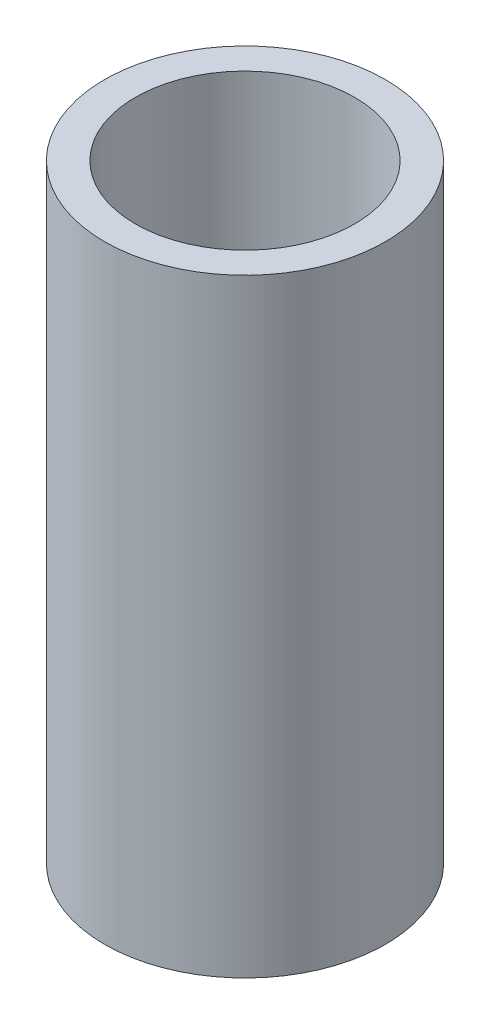
ISO-10303-21;
HEADER;
FILE_DESCRIPTION(('STEP AP214'),'2;1');
FILE_NAME('part.step','',(''),(''),'','','');
FILE_SCHEMA(('AUTOMOTIVE_DESIGN { 1 0 10303 214 1 1 1 1 }'));
ENDSEC;
DATA;
#1=APPLICATION_CONTEXT('core data for automotive mechanical design processes');
#2=APPLICATION_PROTOCOL_DEFINITION('international standard','automotive_design',2000,#1);
#3=PRODUCT_CONTEXT('',#1,'mechanical');
#4=PRODUCT('Part','Part','',(#3));
#5=PRODUCT_RELATED_PRODUCT_CATEGORY('part','',(#4));
#6=PRODUCT_DEFINITION_FORMATION('','',#4);
#7=PRODUCT_DEFINITION_CONTEXT('part definition',#1,'design');
#8=PRODUCT_DEFINITION('design','',#6,#7);
#9=PRODUCT_DEFINITION_SHAPE('','',#8);
#10=(LENGTH_UNIT() NAMED_UNIT(*) SI_UNIT(.MILLI.,.METRE.));
#11=(NAMED_UNIT(*) PLANE_ANGLE_UNIT() SI_UNIT($,.RADIAN.));
#12=(NAMED_UNIT(*) SI_UNIT($,.STERADIAN.) SOLID_ANGLE_UNIT());
#13=UNCERTAINTY_MEASURE_WITH_UNIT(LENGTH_MEASURE(1.E-05),#10,'distance_accuracy_value','');
#14=(GEOMETRIC_REPRESENTATION_CONTEXT(3) GLOBAL_UNCERTAINTY_ASSIGNED_CONTEXT((#13)) GLOBAL_UNIT_ASSIGNED_CONTEXT((#10,
#11,#12)) REPRESENTATION_CONTEXT('',''));
#15=CARTESIAN_POINT('',(0.,0.,0.));
#16=DIRECTION('',(0.,0.,1.));
#17=DIRECTION('',(1.,0.,0.));
#18=AXIS2_PLACEMENT_3D('',#15,#16,#17);
#19=CARTESIAN_POINT('',(0.,75.8407892271156,0.));
#20=DIRECTION('',(0.,-1.,0.));
#21=DIRECTION('',(0.,0.,-1.));
#22=AXIS2_PLACEMENT_3D('',#19,#20,#21);
#23=CYLINDRICAL_SURFACE('',#22,17.5);
#24=CARTESIAN_POINT('',(0.,75.8407892271156,0.));
#25=DIRECTION('',(0.,1.,0.));
#26=DIRECTION('',(0.,0.,1.));
#27=AXIS2_PLACEMENT_3D('',#24,#25,#26);
#28=CIRCLE('',#27,17.5);
#29=CARTESIAN_POINT('',(0.,75.8407892271156,17.5));
#30=VERTEX_POINT('',#29);
#31=EDGE_CURVE('E10',#30,#30,#28,.T.);
#32=ORIENTED_EDGE('',*,*,#31,.F.);
#33=EDGE_LOOP('',(#32));
#34=FACE_BOUND('',#33,.T.);
#35=CARTESIAN_POINT('',(0.,0.,0.));
#36=DIRECTION('',(0.,1.,0.));
#37=DIRECTION('',(0.,0.,1.));
#38=AXIS2_PLACEMENT_3D('',#35,#36,#37);
#39=CIRCLE('',#38,17.5);
#40=CARTESIAN_POINT('',(0.,0.,17.5));
#41=VERTEX_POINT('',#40);
#42=EDGE_CURVE('E37',#41,#41,#39,.T.);
#43=ORIENTED_EDGE('',*,*,#42,.T.);
#44=EDGE_LOOP('',(#43));
#45=FACE_BOUND('',#44,.T.);
#46=ADVANCED_FACE('F40',(#34,#45),#23,.T.);
#47=CARTESIAN_POINT('',(0.,75.8407892271156,0.));
#48=DIRECTION('',(0.,1.,0.));
#49=DIRECTION('',(0.,0.,1.));
#50=AXIS2_PLACEMENT_3D('',#47,#48,#49);
#51=PLANE('',#50);
#52=CARTESIAN_POINT('',(0.,75.8407892271156,0.));
#53=DIRECTION('',(0.,1.,0.));
#54=DIRECTION('',(0.,0.,1.));
#55=AXIS2_PLACEMENT_3D('',#52,#53,#54);
#56=CIRCLE('',#55,13.6699657997169);
#57=CARTESIAN_POINT('',(0.,75.8407892271156,13.6699657997169));
#58=VERTEX_POINT('',#57);
#59=EDGE_CURVE('E50',#58,#58,#56,.T.);
#60=ORIENTED_EDGE('',*,*,#59,.F.);
#61=EDGE_LOOP('',(#60));
#62=FACE_BOUND('',#61,.T.);
#63=ORIENTED_EDGE('',*,*,#31,.T.);
#64=EDGE_LOOP('',(#63));
#65=FACE_BOUND('',#64,.T.);
#66=ADVANCED_FACE('F59',(#62,#65),#51,.T.);
#67=CARTESIAN_POINT('',(0.,0.,0.));
#68=DIRECTION('',(0.,1.,0.));
#69=DIRECTION('',(0.,0.,1.));
#70=AXIS2_PLACEMENT_3D('',#67,#68,#69);
#71=PLANE('',#70);
#72=CARTESIAN_POINT('',(0.,0.,0.));
#73=DIRECTION('',(0.,1.,0.));
#74=DIRECTION('',(0.,0.,1.));
#75=AXIS2_PLACEMENT_3D('',#72,#73,#74);
#76=CIRCLE('',#75,13.6699657997169);
#77=CARTESIAN_POINT('',(0.,0.,13.6699657997169));
#78=VERTEX_POINT('',#77);
#79=EDGE_CURVE('E47',#78,#78,#76,.T.);
#80=ORIENTED_EDGE('',*,*,#79,.T.);
#81=EDGE_LOOP('',(#80));
#82=FACE_BOUND('',#81,.T.);
#83=ORIENTED_EDGE('',*,*,#42,.F.);
#84=EDGE_LOOP('',(#83));
#85=FACE_BOUND('',#84,.T.);
#86=ADVANCED_FACE('F58',(#82,#85),#71,.F.);
#87=CARTESIAN_POINT('',(0.,75.8407892271156,0.));
#88=DIRECTION('',(0.,-1.,0.));
#89=DIRECTION('',(0.,0.,-1.));
#90=AXIS2_PLACEMENT_3D('',#87,#88,#89);
#91=CYLINDRICAL_SURFACE('',#90,13.6699657997169);
#92=ORIENTED_EDGE('',*,*,#59,.T.);
#93=EDGE_LOOP('',(#92));
#94=FACE_BOUND('',#93,.T.);
#95=ORIENTED_EDGE('',*,*,#79,.F.);
#96=EDGE_LOOP('',(#95));
#97=FACE_BOUND('',#96,.T.);
#98=ADVANCED_FACE('F54',(#94,#97),#91,.F.);
#99=CLOSED_SHELL('',(#46,#66,#86,#98));
#100=MANIFOLD_SOLID_BREP('B2',#99);
#101=ADVANCED_BREP_SHAPE_REPRESENTATION('',(#18,#100),#14);
#102=SHAPE_DEFINITION_REPRESENTATION(#9,#101);
ENDSEC;
END-ISO-10303-21;
